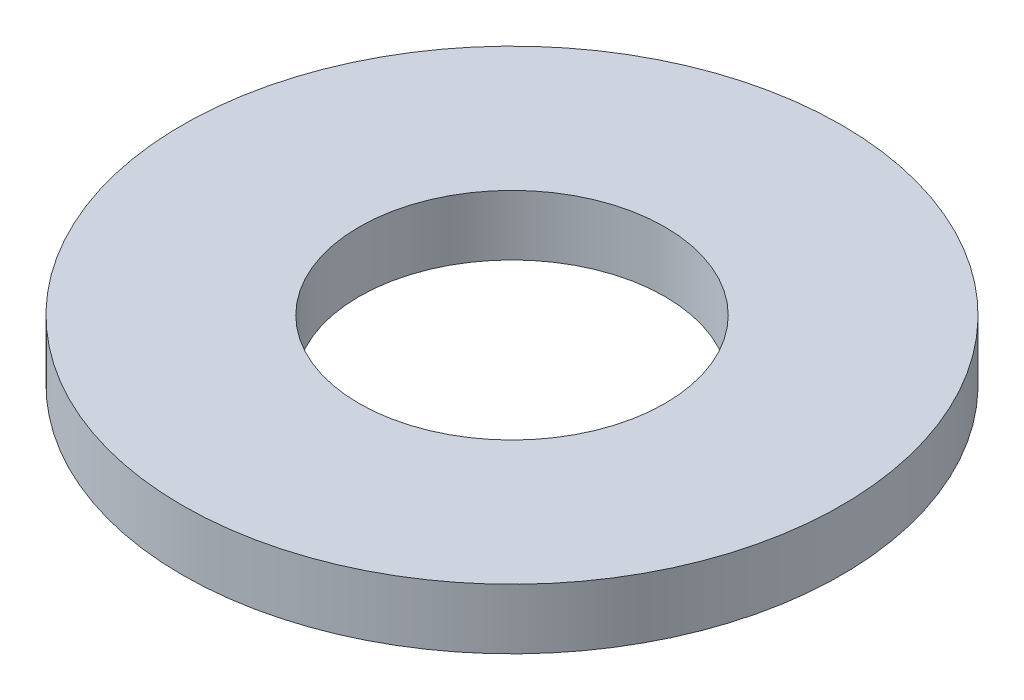
ISO-10303-21;
HEADER;
FILE_DESCRIPTION(('STEP AP214'),'2;1');
FILE_NAME('part.step','',(''),(''),'','','');
FILE_SCHEMA(('AUTOMOTIVE_DESIGN { 1 0 10303 214 1 1 1 1 }'));
ENDSEC;
DATA;
#1=APPLICATION_CONTEXT('core data for automotive mechanical design processes');
#2=APPLICATION_PROTOCOL_DEFINITION('international standard','automotive_design',2000,#1);
#3=PRODUCT_CONTEXT('',#1,'mechanical');
#4=PRODUCT('Part','Part','',(#3));
#5=PRODUCT_RELATED_PRODUCT_CATEGORY('part','',(#4));
#6=PRODUCT_DEFINITION_FORMATION('','',#4);
#7=PRODUCT_DEFINITION_CONTEXT('part definition',#1,'design');
#8=PRODUCT_DEFINITION('design','',#6,#7);
#9=PRODUCT_DEFINITION_SHAPE('','',#8);
#10=(LENGTH_UNIT() NAMED_UNIT(*) SI_UNIT(.MILLI.,.METRE.));
#11=(NAMED_UNIT(*) PLANE_ANGLE_UNIT() SI_UNIT($,.RADIAN.));
#12=(NAMED_UNIT(*) SI_UNIT($,.STERADIAN.) SOLID_ANGLE_UNIT());
#13=UNCERTAINTY_MEASURE_WITH_UNIT(LENGTH_MEASURE(1.E-05),#10,'distance_accuracy_value','');
#14=(GEOMETRIC_REPRESENTATION_CONTEXT(3) GLOBAL_UNCERTAINTY_ASSIGNED_CONTEXT((#13)) GLOBAL_UNIT_ASSIGNED_CONTEXT((#10,
#11,#12)) REPRESENTATION_CONTEXT('',''));
#15=CARTESIAN_POINT('',(0.,0.,0.));
#16=DIRECTION('',(0.,0.,1.));
#17=DIRECTION('',(1.,0.,0.));
#18=AXIS2_PLACEMENT_3D('',#15,#16,#17);
#19=CARTESIAN_POINT('',(0.,1.016,0.));
#20=DIRECTION('',(0.,-1.,0.));
#21=DIRECTION('',(0.,0.,-1.));
#22=AXIS2_PLACEMENT_3D('',#19,#20,#21);
#23=CYLINDRICAL_SURFACE('',#22,5.55625);
#24=CARTESIAN_POINT('',(0.,1.016,0.));
#25=DIRECTION('',(0.,1.,0.));
#26=DIRECTION('',(0.,0.,1.));
#27=AXIS2_PLACEMENT_3D('',#24,#25,#26);
#28=CIRCLE('',#27,5.55625);
#29=CARTESIAN_POINT('',(0.,1.016,5.55625));
#30=VERTEX_POINT('',#29);
#31=EDGE_CURVE('E10',#30,#30,#28,.T.);
#32=ORIENTED_EDGE('',*,*,#31,.F.);
#33=EDGE_LOOP('',(#32));
#34=FACE_BOUND('',#33,.T.);
#35=CARTESIAN_POINT('',(0.,0.,0.));
#36=DIRECTION('',(0.,1.,0.));
#37=DIRECTION('',(0.,0.,1.));
#38=AXIS2_PLACEMENT_3D('',#35,#36,#37);
#39=CIRCLE('',#38,5.55625);
#40=CARTESIAN_POINT('',(0.,0.,5.55625));
#41=VERTEX_POINT('',#40);
#42=EDGE_CURVE('E35',#41,#41,#39,.T.);
#43=ORIENTED_EDGE('',*,*,#42,.T.);
#44=EDGE_LOOP('',(#43));
#45=FACE_BOUND('',#44,.T.);
#46=ADVANCED_FACE('F32',(#34,#45),#23,.T.);
#47=CARTESIAN_POINT('',(0.,1.016,0.));
#48=DIRECTION('',(0.,1.,0.));
#49=DIRECTION('',(0.,0.,1.));
#50=AXIS2_PLACEMENT_3D('',#47,#48,#49);
#51=PLANE('',#50);
#52=CARTESIAN_POINT('',(0.,1.016,0.));
#53=DIRECTION('',(0.,1.,0.));
#54=DIRECTION('',(0.,0.,1.));
#55=AXIS2_PLACEMENT_3D('',#52,#53,#54);
#56=CIRCLE('',#55,2.5781);
#57=CARTESIAN_POINT('',(0.,1.016,2.5781));
#58=VERTEX_POINT('',#57);
#59=EDGE_CURVE('E44',#58,#58,#56,.T.);
#60=ORIENTED_EDGE('',*,*,#59,.F.);
#61=EDGE_LOOP('',(#60));
#62=FACE_BOUND('',#61,.T.);
#63=ORIENTED_EDGE('',*,*,#31,.T.);
#64=EDGE_LOOP('',(#63));
#65=FACE_BOUND('',#64,.T.);
#66=ADVANCED_FACE('F59',(#62,#65),#51,.T.);
#67=CARTESIAN_POINT('',(0.,0.,0.));
#68=DIRECTION('',(0.,1.,0.));
#69=DIRECTION('',(0.,0.,1.));
#70=AXIS2_PLACEMENT_3D('',#67,#68,#69);
#71=PLANE('',#70);
#72=CARTESIAN_POINT('',(0.,0.,0.));
#73=DIRECTION('',(0.,1.,0.));
#74=DIRECTION('',(0.,0.,1.));
#75=AXIS2_PLACEMENT_3D('',#72,#73,#74);
#76=CIRCLE('',#75,2.5781);
#77=CARTESIAN_POINT('',(0.,0.,2.5781));
#78=VERTEX_POINT('',#77);
#79=EDGE_CURVE('E42',#78,#78,#76,.T.);
#80=ORIENTED_EDGE('',*,*,#79,.T.);
#81=EDGE_LOOP('',(#80));
#82=FACE_BOUND('',#81,.T.);
#83=ORIENTED_EDGE('',*,*,#42,.F.);
#84=EDGE_LOOP('',(#83));
#85=FACE_BOUND('',#84,.T.);
#86=ADVANCED_FACE('F50',(#82,#85),#71,.F.);
#87=CARTESIAN_POINT('',(0.,0.,0.));
#88=DIRECTION('',(0.,1.,0.));
#89=DIRECTION('',(0.,0.,1.));
#90=AXIS2_PLACEMENT_3D('',#87,#88,#89);
#91=CYLINDRICAL_SURFACE('',#90,2.5781);
#92=ORIENTED_EDGE('',*,*,#79,.F.);
#93=EDGE_LOOP('',(#92));
#94=FACE_BOUND('',#93,.T.);
#95=ORIENTED_EDGE('',*,*,#59,.T.);
#96=EDGE_LOOP('',(#95));
#97=FACE_BOUND('',#96,.T.);
#98=ADVANCED_FACE('F53',(#94,#97),#91,.F.);
#99=CLOSED_SHELL('',(#46,#66,#86,#98));
#100=MANIFOLD_SOLID_BREP('B2',#99);
#101=ADVANCED_BREP_SHAPE_REPRESENTATION('',(#18,#100),#14);
#102=SHAPE_DEFINITION_REPRESENTATION(#9,#101);
ENDSEC;
END-ISO-10303-21;
